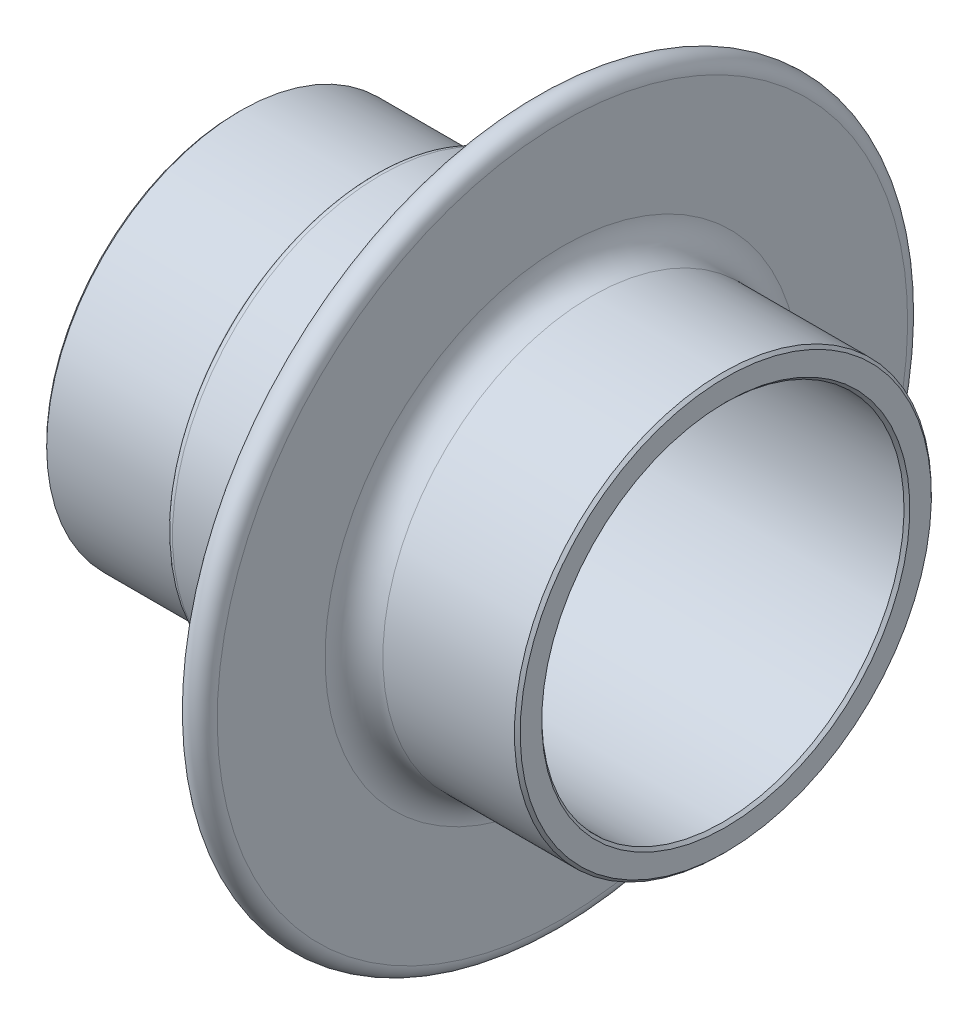
ISO-10303-21;
HEADER;
FILE_DESCRIPTION(('STEP AP214'),'2;1');
FILE_NAME('part.step','',(''),(''),'','','');
FILE_SCHEMA(('AUTOMOTIVE_DESIGN { 1 0 10303 214 1 1 1 1 }'));
ENDSEC;
DATA;
#1=APPLICATION_CONTEXT('core data for automotive mechanical design processes');
#2=APPLICATION_PROTOCOL_DEFINITION('international standard','automotive_design',2000,#1);
#3=PRODUCT_CONTEXT('',#1,'mechanical');
#4=PRODUCT('Part','Part','',(#3));
#5=PRODUCT_RELATED_PRODUCT_CATEGORY('part','',(#4));
#6=PRODUCT_DEFINITION_FORMATION('','',#4);
#7=PRODUCT_DEFINITION_CONTEXT('part definition',#1,'design');
#8=PRODUCT_DEFINITION('design','',#6,#7);
#9=PRODUCT_DEFINITION_SHAPE('','',#8);
#10=(LENGTH_UNIT() NAMED_UNIT(*) SI_UNIT(.MILLI.,.METRE.));
#11=(NAMED_UNIT(*) PLANE_ANGLE_UNIT() SI_UNIT($,.RADIAN.));
#12=(NAMED_UNIT(*) SI_UNIT($,.STERADIAN.) SOLID_ANGLE_UNIT());
#13=UNCERTAINTY_MEASURE_WITH_UNIT(LENGTH_MEASURE(1.E-05),#10,'distance_accuracy_value','');
#14=(GEOMETRIC_REPRESENTATION_CONTEXT(3) GLOBAL_UNCERTAINTY_ASSIGNED_CONTEXT((#13)) GLOBAL_UNIT_ASSIGNED_CONTEXT((#10,
#11,#12)) REPRESENTATION_CONTEXT('',''));
#15=CARTESIAN_POINT('',(0.,0.,0.));
#16=DIRECTION('',(0.,0.,1.));
#17=DIRECTION('',(1.,0.,0.));
#18=AXIS2_PLACEMENT_3D('',#15,#16,#17);
#19=CARTESIAN_POINT('',(0.,17.0434,0.));
#20=DIRECTION('',(1.,0.,0.));
#21=DIRECTION('',(0.,1.,0.));
#22=AXIS2_PLACEMENT_3D('',#19,#20,#21);
#23=PLANE('',#22);
#24=CARTESIAN_POINT('',(0.,0.,0.));
#25=DIRECTION('',(-1.,0.,0.));
#26=DIRECTION('',(0.,1.,0.));
#27=AXIS2_PLACEMENT_3D('',#24,#25,#26);
#28=CIRCLE('',#27,16.7894);
#29=CARTESIAN_POINT('',(0.,16.7894,0.));
#30=VERTEX_POINT('',#29);
#31=EDGE_CURVE('E63',#30,#30,#28,.F.);
#32=ORIENTED_EDGE('',*,*,#31,.F.);
#33=EDGE_LOOP('',(#32));
#34=FACE_BOUND('',#33,.T.);
#35=CARTESIAN_POINT('',(0.,0.,0.));
#36=DIRECTION('',(-1.,0.,0.));
#37=DIRECTION('',(0.,1.,0.));
#38=AXIS2_PLACEMENT_3D('',#35,#36,#37);
#39=CIRCLE('',#38,15.748);
#40=CARTESIAN_POINT('',(0.,15.748,0.));
#41=VERTEX_POINT('',#40);
#42=EDGE_CURVE('E66',#41,#41,#39,.T.);
#43=ORIENTED_EDGE('',*,*,#42,.F.);
#44=EDGE_LOOP('',(#43));
#45=FACE_BOUND('',#44,.T.);
#46=ADVANCED_FACE('F37',(#34,#45),#23,.F.);
#47=CARTESIAN_POINT('',(0.,0.,0.));
#48=DIRECTION('',(-1.,0.,0.));
#49=DIRECTION('',(0.,-1.,0.));
#50=AXIS2_PLACEMENT_3D('',#47,#48,#49);
#51=CYLINDRICAL_SURFACE('',#50,17.0434);
#52=CARTESIAN_POINT('',(0.25400000000002,0.,0.));
#53=DIRECTION('',(-1.,0.,0.));
#54=DIRECTION('',(0.,1.,0.));
#55=AXIS2_PLACEMENT_3D('',#52,#53,#54);
#56=CIRCLE('',#55,17.0434);
#57=CARTESIAN_POINT('',(0.254000000000017,17.0434,0.));
#58=VERTEX_POINT('',#57);
#59=EDGE_CURVE('E60',#58,#58,#56,.T.);
#60=ORIENTED_EDGE('',*,*,#59,.F.);
#61=EDGE_LOOP('',(#60));
#62=FACE_BOUND('',#61,.T.);
#63=CARTESIAN_POINT('',(11.303,0.,0.));
#64=DIRECTION('',(1.,0.,0.));
#65=DIRECTION('',(0.,-1.,0.));
#66=AXIS2_PLACEMENT_3D('',#63,#64,#65);
#67=CIRCLE('',#66,17.0434);
#68=CARTESIAN_POINT('',(11.303,-17.0434,0.));
#69=VERTEX_POINT('',#68);
#70=EDGE_CURVE('E112',#69,#69,#67,.T.);
#71=ORIENTED_EDGE('',*,*,#70,.F.);
#72=EDGE_LOOP('',(#71));
#73=FACE_BOUND('',#72,.T.);
#74=ADVANCED_FACE('F148',(#62,#73),#51,.T.);
#75=CARTESIAN_POINT('',(11.303,0.,0.));
#76=DIRECTION('',(-1.,0.,0.));
#77=DIRECTION('',(0.,-1.,0.));
#78=AXIS2_PLACEMENT_3D('',#75,#76,#77);
#79=TOROIDAL_SURFACE('',#78,17.6784,0.634999999999998);
#80=ORIENTED_EDGE('',*,*,#70,.T.);
#81=EDGE_LOOP('',(#80));
#82=FACE_BOUND('',#81,.T.);
#83=CARTESIAN_POINT('',(11.938,0.,0.));
#84=DIRECTION('',(1.,0.,0.));
#85=DIRECTION('',(0.,-1.,0.));
#86=AXIS2_PLACEMENT_3D('',#83,#84,#85);
#87=CIRCLE('',#86,17.6784);
#88=CARTESIAN_POINT('',(11.938,-17.6784,0.));
#89=VERTEX_POINT('',#88);
#90=EDGE_CURVE('E115',#89,#89,#87,.T.);
#91=ORIENTED_EDGE('',*,*,#90,.F.);
#92=EDGE_LOOP('',(#91));
#93=FACE_BOUND('',#92,.T.);
#94=ADVANCED_FACE('F154',(#82,#93),#79,.F.);
#95=CARTESIAN_POINT('',(12.573,0.,0.));
#96=DIRECTION('',(-1.,0.,0.));
#97=DIRECTION('',(0.,-1.,0.));
#98=AXIS2_PLACEMENT_3D('',#95,#96,#97);
#99=TOROIDAL_SURFACE('',#98,17.6784,0.634999999999998);
#100=ORIENTED_EDGE('',*,*,#90,.T.);
#101=EDGE_LOOP('',(#100));
#102=FACE_BOUND('',#101,.T.);
#103=CARTESIAN_POINT('',(12.573,0.,0.));
#104=DIRECTION('',(1.,0.,0.));
#105=DIRECTION('',(0.,-1.,0.));
#106=AXIS2_PLACEMENT_3D('',#103,#104,#105);
#107=CIRCLE('',#106,18.3134);
#108=CARTESIAN_POINT('',(12.573,-18.3134,0.));
#109=VERTEX_POINT('',#108);
#110=EDGE_CURVE('E118',#109,#109,#107,.T.);
#111=ORIENTED_EDGE('',*,*,#110,.F.);
#112=EDGE_LOOP('',(#111));
#113=FACE_BOUND('',#112,.T.);
#114=ADVANCED_FACE('F356',(#102,#113),#99,.T.);
#115=CARTESIAN_POINT('',(0.,0.,0.));
#116=DIRECTION('',(-1.,0.,0.));
#117=DIRECTION('',(0.,-1.,0.));
#118=AXIS2_PLACEMENT_3D('',#115,#116,#117);
#119=CYLINDRICAL_SURFACE('',#118,18.3134);
#120=CARTESIAN_POINT('',(23.43288870403,0.,0.));
#121=DIRECTION('',(-1.,0.,0.));
#122=DIRECTION('',(0.,1.,0.));
#123=AXIS2_PLACEMENT_3D('',#120,#121,#122);
#124=CIRCLE('',#123,18.3134);
#125=CARTESIAN_POINT('',(23.43288870403,18.3134,0.));
#126=VERTEX_POINT('',#125);
#127=EDGE_CURVE('E45',#126,#126,#124,.F.);
#128=ORIENTED_EDGE('',*,*,#127,.F.);
#129=EDGE_LOOP('',(#128));
#130=FACE_BOUND('',#129,.T.);
#131=ORIENTED_EDGE('',*,*,#110,.T.);
#132=EDGE_LOOP('',(#131));
#133=FACE_BOUND('',#132,.T.);
#134=ADVANCED_FACE('F144',(#130,#133),#119,.T.);
#135=CARTESIAN_POINT('',(25.97288870403,18.3134,0.));
#136=DIRECTION('',(1.,0.,0.));
#137=DIRECTION('',(0.,1.,0.));
#138=AXIS2_PLACEMENT_3D('',#135,#136,#137);
#139=PLANE('',#138);
#140=CARTESIAN_POINT('',(25.97288870403,0.,0.));
#141=DIRECTION('',(-1.,0.,0.));
#142=DIRECTION('',(0.,1.,0.));
#143=AXIS2_PLACEMENT_3D('',#140,#141,#142);
#144=CIRCLE('',#143,20.8534);
#145=CARTESIAN_POINT('',(25.97288870403,20.8534,0.));
#146=VERTEX_POINT('',#145);
#147=EDGE_CURVE('E10',#146,#146,#144,.T.);
#148=ORIENTED_EDGE('',*,*,#147,.F.);
#149=EDGE_LOOP('',(#148));
#150=FACE_BOUND('',#149,.T.);
#151=CARTESIAN_POINT('',(25.97288870403,0.,0.));
#152=DIRECTION('',(1.,0.,0.));
#153=DIRECTION('',(0.,-1.,0.));
#154=AXIS2_PLACEMENT_3D('',#151,#152,#153);
#155=CIRCLE('',#154,30.32125);
#156=CARTESIAN_POINT('',(25.97288870403,-30.32125,0.));
#157=VERTEX_POINT('',#156);
#158=EDGE_CURVE('E121',#157,#157,#155,.T.);
#159=ORIENTED_EDGE('',*,*,#158,.F.);
#160=EDGE_LOOP('',(#159));
#161=FACE_BOUND('',#160,.T.);
#162=ADVANCED_FACE('F134',(#150,#161),#139,.F.);
#163=CARTESIAN_POINT('',(27.24288870403,0.,0.));
#164=DIRECTION('',(-1.,0.,0.));
#165=DIRECTION('',(0.,-1.,0.));
#166=AXIS2_PLACEMENT_3D('',#163,#164,#165);
#167=TOROIDAL_SURFACE('',#166,30.32125,1.27);
#168=ORIENTED_EDGE('',*,*,#158,.T.);
#169=EDGE_LOOP('',(#168));
#170=FACE_BOUND('',#169,.T.);
#171=CARTESIAN_POINT('',(28.51288870403,0.,0.));
#172=DIRECTION('',(1.,0.,0.));
#173=DIRECTION('',(0.,-1.,0.));
#174=AXIS2_PLACEMENT_3D('',#171,#172,#173);
#175=CIRCLE('',#174,30.32125);
#176=CARTESIAN_POINT('',(28.51288870403,-30.32125,0.));
#177=VERTEX_POINT('',#176);
#178=EDGE_CURVE('E125',#177,#177,#175,.T.);
#179=ORIENTED_EDGE('',*,*,#178,.F.);
#180=EDGE_LOOP('',(#179));
#181=FACE_BOUND('',#180,.T.);
#182=ADVANCED_FACE('F132',(#170,#181),#167,.T.);
#183=CARTESIAN_POINT('',(28.51288870403,18.3134,0.));
#184=DIRECTION('',(-1.,0.,0.));
#185=DIRECTION('',(0.,-1.,0.));
#186=AXIS2_PLACEMENT_3D('',#183,#184,#185);
#187=PLANE('',#186);
#188=CARTESIAN_POINT('',(28.51288870403,0.,0.));
#189=DIRECTION('',(1.,0.,0.));
#190=DIRECTION('',(0.,-1.,0.));
#191=AXIS2_PLACEMENT_3D('',#188,#189,#190);
#192=CIRCLE('',#191,20.8534);
#193=CARTESIAN_POINT('',(28.51288870403,-20.8534,0.));
#194=VERTEX_POINT('',#193);
#195=EDGE_CURVE('E54',#194,#194,#192,.T.);
#196=ORIENTED_EDGE('',*,*,#195,.F.);
#197=EDGE_LOOP('',(#196));
#198=FACE_BOUND('',#197,.T.);
#199=ORIENTED_EDGE('',*,*,#178,.T.);
#200=EDGE_LOOP('',(#199));
#201=FACE_BOUND('',#200,.T.);
#202=ADVANCED_FACE('F130',(#198,#201),#187,.F.);
#203=CARTESIAN_POINT('',(0.,0.,0.));
#204=DIRECTION('',(-1.,0.,0.));
#205=DIRECTION('',(0.,-1.,0.));
#206=AXIS2_PLACEMENT_3D('',#203,#204,#205);
#207=CYLINDRICAL_SURFACE('',#206,18.3134);
#208=CARTESIAN_POINT('',(31.05288870403,0.,0.));
#209=DIRECTION('',(1.,0.,0.));
#210=DIRECTION('',(0.,-1.,0.));
#211=AXIS2_PLACEMENT_3D('',#208,#209,#210);
#212=CIRCLE('',#211,18.3134);
#213=CARTESIAN_POINT('',(31.05288870403,-18.3134,0.));
#214=VERTEX_POINT('',#213);
#215=EDGE_CURVE('E50',#214,#214,#212,.F.);
#216=ORIENTED_EDGE('',*,*,#215,.F.);
#217=EDGE_LOOP('',(#216));
#218=FACE_BOUND('',#217,.T.);
#219=CARTESIAN_POINT('',(42.6085,0.,0.));
#220=DIRECTION('',(1.,0.,0.));
#221=DIRECTION('',(0.,-1.,0.));
#222=AXIS2_PLACEMENT_3D('',#219,#220,#221);
#223=CIRCLE('',#222,18.3134);
#224=CARTESIAN_POINT('',(42.6085,-18.3134,0.));
#225=VERTEX_POINT('',#224);
#226=EDGE_CURVE('E108',#225,#225,#223,.T.);
#227=ORIENTED_EDGE('',*,*,#226,.F.);
#228=EDGE_LOOP('',(#227));
#229=FACE_BOUND('',#228,.T.);
#230=ADVANCED_FACE('F141',(#218,#229),#207,.T.);
#231=CARTESIAN_POINT('',(42.8625,15.9131,0.));
#232=DIRECTION('',(-1.,0.,0.));
#233=DIRECTION('',(0.,-1.,0.));
#234=AXIS2_PLACEMENT_3D('',#231,#232,#233);
#235=PLANE('',#234);
#236=CARTESIAN_POINT('',(42.8625,0.,0.));
#237=DIRECTION('',(1.,0.,0.));
#238=DIRECTION('',(0.,-1.,0.));
#239=AXIS2_PLACEMENT_3D('',#236,#237,#238);
#240=CIRCLE('',#239,18.0594);
#241=CARTESIAN_POINT('',(42.8625,-18.0594,0.));
#242=VERTEX_POINT('',#241);
#243=EDGE_CURVE('E100',#242,#242,#240,.F.);
#244=ORIENTED_EDGE('',*,*,#243,.F.);
#245=EDGE_LOOP('',(#244));
#246=FACE_BOUND('',#245,.T.);
#247=CARTESIAN_POINT('',(42.8625,0.,0.));
#248=DIRECTION('',(1.,0.,0.));
#249=DIRECTION('',(0.,-1.,0.));
#250=AXIS2_PLACEMENT_3D('',#247,#248,#249);
#251=CIRCLE('',#250,16.1671);
#252=CARTESIAN_POINT('',(42.8625,-16.1671,0.));
#253=VERTEX_POINT('',#252);
#254=EDGE_CURVE('E104',#253,#253,#251,.T.);
#255=ORIENTED_EDGE('',*,*,#254,.F.);
#256=EDGE_LOOP('',(#255));
#257=FACE_BOUND('',#256,.T.);
#258=ADVANCED_FACE('F205',(#246,#257),#235,.F.);
#259=CARTESIAN_POINT('',(0.,0.,0.));
#260=DIRECTION('',(-1.,0.,0.));
#261=DIRECTION('',(0.,-1.,0.));
#262=AXIS2_PLACEMENT_3D('',#259,#260,#261);
#263=CYLINDRICAL_SURFACE('',#262,15.9131);
#264=CARTESIAN_POINT('',(42.6085,0.,0.));
#265=DIRECTION('',(1.,0.,0.));
#266=DIRECTION('',(0.,-1.,0.));
#267=AXIS2_PLACEMENT_3D('',#264,#265,#266);
#268=CIRCLE('',#267,15.9131);
#269=CARTESIAN_POINT('',(42.6085,-15.9131,0.));
#270=VERTEX_POINT('',#269);
#271=EDGE_CURVE('E93',#270,#270,#268,.F.);
#272=ORIENTED_EDGE('',*,*,#271,.F.);
#273=EDGE_LOOP('',(#272));
#274=FACE_BOUND('',#273,.T.);
#275=CARTESIAN_POINT('',(15.3035,0.,0.));
#276=DIRECTION('',(1.,0.,0.));
#277=DIRECTION('',(0.,-1.,0.));
#278=AXIS2_PLACEMENT_3D('',#275,#276,#277);
#279=CIRCLE('',#278,15.9131);
#280=CARTESIAN_POINT('',(15.3035,-15.9131,0.));
#281=VERTEX_POINT('',#280);
#282=EDGE_CURVE('E97',#281,#281,#279,.T.);
#283=ORIENTED_EDGE('',*,*,#282,.F.);
#284=EDGE_LOOP('',(#283));
#285=FACE_BOUND('',#284,.T.);
#286=ADVANCED_FACE('F212',(#274,#285),#263,.F.);
#287=CARTESIAN_POINT('',(15.0495,13.49375,0.));
#288=DIRECTION('',(-1.,0.,0.));
#289=DIRECTION('',(0.,-1.,0.));
#290=AXIS2_PLACEMENT_3D('',#287,#288,#289);
#291=PLANE('',#290);
#292=CARTESIAN_POINT('',(15.0495,0.,0.));
#293=DIRECTION('',(1.,0.,0.));
#294=DIRECTION('',(0.,-1.,0.));
#295=AXIS2_PLACEMENT_3D('',#292,#293,#294);
#296=CIRCLE('',#295,15.6591);
#297=CARTESIAN_POINT('',(15.0495,-15.6591,0.));
#298=VERTEX_POINT('',#297);
#299=EDGE_CURVE('E87',#298,#298,#296,.F.);
#300=ORIENTED_EDGE('',*,*,#299,.F.);
#301=EDGE_LOOP('',(#300));
#302=FACE_BOUND('',#301,.T.);
#303=CARTESIAN_POINT('',(15.0495,0.,0.));
#304=DIRECTION('',(1.,0.,0.));
#305=DIRECTION('',(0.,-1.,0.));
#306=AXIS2_PLACEMENT_3D('',#303,#304,#305);
#307=CIRCLE('',#306,13.74775);
#308=CARTESIAN_POINT('',(15.0495,-13.74775,0.));
#309=VERTEX_POINT('',#308);
#310=EDGE_CURVE('E90',#309,#309,#307,.T.);
#311=ORIENTED_EDGE('',*,*,#310,.F.);
#312=EDGE_LOOP('',(#311));
#313=FACE_BOUND('',#312,.T.);
#314=ADVANCED_FACE('F218',(#302,#313),#291,.F.);
#315=CARTESIAN_POINT('',(0.,0.,0.));
#316=DIRECTION('',(-1.,0.,0.));
#317=DIRECTION('',(0.,-1.,0.));
#318=AXIS2_PLACEMENT_3D('',#315,#316,#317);
#319=CYLINDRICAL_SURFACE('',#318,13.49375);
#320=CARTESIAN_POINT('',(14.7955,0.,0.));
#321=DIRECTION('',(1.,0.,0.));
#322=DIRECTION('',(0.,-1.,0.));
#323=AXIS2_PLACEMENT_3D('',#320,#321,#322);
#324=CIRCLE('',#323,13.49375);
#325=CARTESIAN_POINT('',(14.7955,-13.49375,0.));
#326=VERTEX_POINT('',#325);
#327=EDGE_CURVE('E81',#326,#326,#324,.F.);
#328=ORIENTED_EDGE('',*,*,#327,.F.);
#329=EDGE_LOOP('',(#328));
#330=FACE_BOUND('',#329,.T.);
#331=CARTESIAN_POINT('',(4.95300000000003,0.,0.));
#332=DIRECTION('',(-1.,0.,0.));
#333=DIRECTION('',(0.,1.,0.));
#334=AXIS2_PLACEMENT_3D('',#331,#332,#333);
#335=CIRCLE('',#334,13.49375);
#336=CARTESIAN_POINT('',(4.95300000000003,13.49375,0.));
#337=VERTEX_POINT('',#336);
#338=EDGE_CURVE('E84',#337,#337,#335,.F.);
#339=ORIENTED_EDGE('',*,*,#338,.F.);
#340=EDGE_LOOP('',(#339));
#341=FACE_BOUND('',#340,.T.);
#342=ADVANCED_FACE('F222',(#330,#341),#319,.F.);
#343=CARTESIAN_POINT('',(4.699,15.494,0.));
#344=DIRECTION('',(1.,0.,0.));
#345=DIRECTION('',(0.,1.,0.));
#346=AXIS2_PLACEMENT_3D('',#343,#344,#345);
#347=PLANE('',#346);
#348=CARTESIAN_POINT('',(4.699,0.,0.));
#349=DIRECTION('',(-1.,0.,0.));
#350=DIRECTION('',(0.,1.,0.));
#351=AXIS2_PLACEMENT_3D('',#348,#349,#350);
#352=CIRCLE('',#351,13.74775);
#353=CARTESIAN_POINT('',(4.699,13.74775,0.));
#354=VERTEX_POINT('',#353);
#355=EDGE_CURVE('E75',#354,#354,#352,.T.);
#356=ORIENTED_EDGE('',*,*,#355,.F.);
#357=EDGE_LOOP('',(#356));
#358=FACE_BOUND('',#357,.T.);
#359=CARTESIAN_POINT('',(4.699,0.,0.));
#360=DIRECTION('',(-1.,0.,0.));
#361=DIRECTION('',(0.,1.,0.));
#362=AXIS2_PLACEMENT_3D('',#359,#360,#361);
#363=CIRCLE('',#362,15.24);
#364=CARTESIAN_POINT('',(4.699,15.24,0.));
#365=VERTEX_POINT('',#364);
#366=EDGE_CURVE('E78',#365,#365,#363,.F.);
#367=ORIENTED_EDGE('',*,*,#366,.F.);
#368=EDGE_LOOP('',(#367));
#369=FACE_BOUND('',#368,.T.);
#370=ADVANCED_FACE('F226',(#358,#369),#347,.F.);
#371=CARTESIAN_POINT('',(0.,0.,0.));
#372=DIRECTION('',(-1.,0.,0.));
#373=DIRECTION('',(0.,-1.,0.));
#374=AXIS2_PLACEMENT_3D('',#371,#372,#373);
#375=CYLINDRICAL_SURFACE('',#374,15.494);
#376=CARTESIAN_POINT('',(4.44499999999997,0.,0.));
#377=DIRECTION('',(-1.,0.,0.));
#378=DIRECTION('',(0.,1.,0.));
#379=AXIS2_PLACEMENT_3D('',#376,#377,#378);
#380=CIRCLE('',#379,15.494);
#381=CARTESIAN_POINT('',(4.44499999999997,15.494,0.));
#382=VERTEX_POINT('',#381);
#383=EDGE_CURVE('E69',#382,#382,#380,.T.);
#384=ORIENTED_EDGE('',*,*,#383,.F.);
#385=EDGE_LOOP('',(#384));
#386=FACE_BOUND('',#385,.T.);
#387=CARTESIAN_POINT('',(0.253999999999997,0.,0.));
#388=DIRECTION('',(-1.,0.,0.));
#389=DIRECTION('',(0.,1.,0.));
#390=AXIS2_PLACEMENT_3D('',#387,#388,#389);
#391=CIRCLE('',#390,15.494);
#392=CARTESIAN_POINT('',(0.253999999999994,15.494,0.));
#393=VERTEX_POINT('',#392);
#394=EDGE_CURVE('E72',#393,#393,#391,.F.);
#395=ORIENTED_EDGE('',*,*,#394,.F.);
#396=EDGE_LOOP('',(#395));
#397=FACE_BOUND('',#396,.T.);
#398=ADVANCED_FACE('F165',(#386,#397),#375,.F.);
#399=CARTESIAN_POINT('',(42.6085,0.,0.));
#400=DIRECTION('',(-1.,0.,0.));
#401=DIRECTION('',(0.,-1.,0.));
#402=AXIS2_PLACEMENT_3D('',#399,#400,#401);
#403=CONICAL_SURFACE('',#402,18.3134,0.785398163397448);
#404=ORIENTED_EDGE('',*,*,#243,.T.);
#405=EDGE_LOOP('',(#404));
#406=FACE_BOUND('',#405,.T.);
#407=ORIENTED_EDGE('',*,*,#226,.T.);
#408=EDGE_LOOP('',(#407));
#409=FACE_BOUND('',#408,.T.);
#410=ADVANCED_FACE('F161',(#406,#409),#403,.T.);
#411=CARTESIAN_POINT('',(42.8625,0.,0.));
#412=DIRECTION('',(1.,0.,0.));
#413=DIRECTION('',(0.,1.,0.));
#414=AXIS2_PLACEMENT_3D('',#411,#412,#413);
#415=CONICAL_SURFACE('',#414,16.1671,0.785398163397442);
#416=ORIENTED_EDGE('',*,*,#271,.T.);
#417=EDGE_LOOP('',(#416));
#418=FACE_BOUND('',#417,.T.);
#419=ORIENTED_EDGE('',*,*,#254,.T.);
#420=EDGE_LOOP('',(#419));
#421=FACE_BOUND('',#420,.T.);
#422=ADVANCED_FACE('F164',(#418,#421),#415,.F.);
#423=CARTESIAN_POINT('',(15.3035,0.,0.));
#424=DIRECTION('',(1.,0.,0.));
#425=DIRECTION('',(0.,1.,0.));
#426=AXIS2_PLACEMENT_3D('',#423,#424,#425);
#427=CONICAL_SURFACE('',#426,15.9131,0.785398163397428);
#428=ORIENTED_EDGE('',*,*,#299,.T.);
#429=EDGE_LOOP('',(#428));
#430=FACE_BOUND('',#429,.T.);
#431=ORIENTED_EDGE('',*,*,#282,.T.);
#432=EDGE_LOOP('',(#431));
#433=FACE_BOUND('',#432,.T.);
#434=ADVANCED_FACE('F169',(#430,#433),#427,.F.);
#435=CARTESIAN_POINT('',(15.0495,0.,0.));
#436=DIRECTION('',(1.,0.,0.));
#437=DIRECTION('',(0.,1.,0.));
#438=AXIS2_PLACEMENT_3D('',#435,#436,#437);
#439=CONICAL_SURFACE('',#438,13.74775,0.785398163397448);
#440=ORIENTED_EDGE('',*,*,#327,.T.);
#441=EDGE_LOOP('',(#440));
#442=FACE_BOUND('',#441,.T.);
#443=ORIENTED_EDGE('',*,*,#310,.T.);
#444=EDGE_LOOP('',(#443));
#445=FACE_BOUND('',#444,.T.);
#446=ADVANCED_FACE('F173',(#442,#445),#439,.F.);
#447=CARTESIAN_POINT('',(4.95300000000003,0.,0.));
#448=DIRECTION('',(-1.,0.,0.));
#449=DIRECTION('',(0.,-1.,0.));
#450=AXIS2_PLACEMENT_3D('',#447,#448,#449);
#451=CONICAL_SURFACE('',#450,13.49375,0.785398163397469);
#452=ORIENTED_EDGE('',*,*,#355,.T.);
#453=EDGE_LOOP('',(#452));
#454=FACE_BOUND('',#453,.T.);
#455=ORIENTED_EDGE('',*,*,#338,.T.);
#456=EDGE_LOOP('',(#455));
#457=FACE_BOUND('',#456,.T.);
#458=ADVANCED_FACE('F177',(#454,#457),#451,.F.);
#459=CARTESIAN_POINT('',(4.699,0.,0.));
#460=DIRECTION('',(-1.,0.,0.));
#461=DIRECTION('',(0.,-1.,0.));
#462=AXIS2_PLACEMENT_3D('',#459,#460,#461);
#463=CONICAL_SURFACE('',#462,15.24,0.785398163397448);
#464=ORIENTED_EDGE('',*,*,#383,.T.);
#465=EDGE_LOOP('',(#464));
#466=FACE_BOUND('',#465,.T.);
#467=ORIENTED_EDGE('',*,*,#366,.T.);
#468=EDGE_LOOP('',(#467));
#469=FACE_BOUND('',#468,.T.);
#470=ADVANCED_FACE('F181',(#466,#469),#463,.F.);
#471=CARTESIAN_POINT('',(0.,0.,0.));
#472=DIRECTION('',(1.,0.,0.));
#473=DIRECTION('',(0.,1.,0.));
#474=AXIS2_PLACEMENT_3D('',#471,#472,#473);
#475=CONICAL_SURFACE('',#474,16.7894,0.785398163397435);
#476=ORIENTED_EDGE('',*,*,#59,.T.);
#477=EDGE_LOOP('',(#476));
#478=FACE_BOUND('',#477,.T.);
#479=ORIENTED_EDGE('',*,*,#31,.T.);
#480=EDGE_LOOP('',(#479));
#481=FACE_BOUND('',#480,.T.);
#482=ADVANCED_FACE('F185',(#478,#481),#475,.T.);
#483=CARTESIAN_POINT('',(0.253999999999997,0.,0.));
#484=DIRECTION('',(-1.,0.,0.));
#485=DIRECTION('',(0.,-1.,0.));
#486=AXIS2_PLACEMENT_3D('',#483,#484,#485);
#487=CONICAL_SURFACE('',#486,15.494,0.785398163397462);
#488=ORIENTED_EDGE('',*,*,#42,.T.);
#489=EDGE_LOOP('',(#488));
#490=FACE_BOUND('',#489,.T.);
#491=ORIENTED_EDGE('',*,*,#394,.T.);
#492=EDGE_LOOP('',(#491));
#493=FACE_BOUND('',#492,.T.);
#494=ADVANCED_FACE('F189',(#490,#493),#487,.F.);
#495=CARTESIAN_POINT('',(31.05288870403,0.,0.));
#496=DIRECTION('',(-1.,0.,0.));
#497=DIRECTION('',(0.,-1.,0.));
#498=AXIS2_PLACEMENT_3D('',#495,#496,#497);
#499=TOROIDAL_SURFACE('',#498,20.8534,2.54);
#500=ORIENTED_EDGE('',*,*,#215,.T.);
#501=EDGE_LOOP('',(#500));
#502=FACE_BOUND('',#501,.T.);
#503=ORIENTED_EDGE('',*,*,#195,.T.);
#504=EDGE_LOOP('',(#503));
#505=FACE_BOUND('',#504,.T.);
#506=ADVANCED_FACE('F192',(#502,#505),#499,.F.);
#507=CARTESIAN_POINT('',(23.43288870403,0.,0.));
#508=DIRECTION('',(1.,0.,0.));
#509=DIRECTION('',(0.,1.,0.));
#510=AXIS2_PLACEMENT_3D('',#507,#508,#509);
#511=TOROIDAL_SURFACE('',#510,20.8534,2.54);
#512=ORIENTED_EDGE('',*,*,#147,.T.);
#513=EDGE_LOOP('',(#512));
#514=FACE_BOUND('',#513,.T.);
#515=ORIENTED_EDGE('',*,*,#127,.T.);
#516=EDGE_LOOP('',(#515));
#517=FACE_BOUND('',#516,.T.);
#518=ADVANCED_FACE('F39',(#514,#517),#511,.F.);
#519=CLOSED_SHELL('',(#46,#74,#94,#114,#134,#162,#182,#202,#230,#258,#286,#314,#342,#370,#398,
#410,#422,#434,#446,#458,#470,#482,#494,#506,#518));
#520=MANIFOLD_SOLID_BREP('B2',#519);
#521=ADVANCED_BREP_SHAPE_REPRESENTATION('',(#18,#520),#14);
#522=SHAPE_DEFINITION_REPRESENTATION(#9,#521);
ENDSEC;
END-ISO-10303-21;
